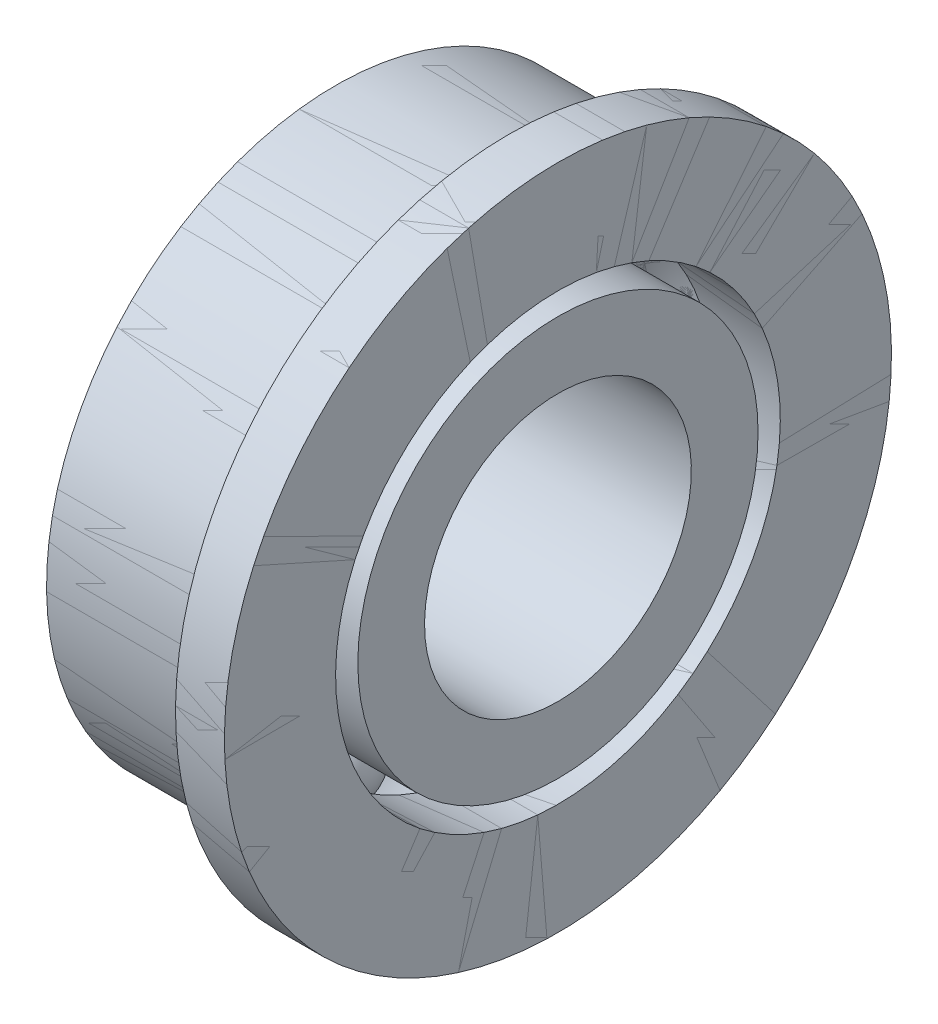
ISO-10303-21;
HEADER;
FILE_DESCRIPTION(('STEP AP214'),'2;1');
FILE_NAME('part.step','',(''),(''),'','','');
FILE_SCHEMA(('AUTOMOTIVE_DESIGN { 1 0 10303 214 1 1 1 1 }'));
ENDSEC;
DATA;
#1=APPLICATION_CONTEXT('core data for automotive mechanical design processes');
#2=APPLICATION_PROTOCOL_DEFINITION('international standard','automotive_design',2000,#1);
#3=PRODUCT_CONTEXT('',#1,'mechanical');
#4=PRODUCT('Part','Part','',(#3));
#5=PRODUCT_RELATED_PRODUCT_CATEGORY('part','',(#4));
#6=PRODUCT_DEFINITION_FORMATION('','',#4);
#7=PRODUCT_DEFINITION_CONTEXT('part definition',#1,'design');
#8=PRODUCT_DEFINITION('design','',#6,#7);
#9=PRODUCT_DEFINITION_SHAPE('','',#8);
#10=(LENGTH_UNIT() NAMED_UNIT(*) SI_UNIT(.MILLI.,.METRE.));
#11=(NAMED_UNIT(*) PLANE_ANGLE_UNIT() SI_UNIT($,.RADIAN.));
#12=(NAMED_UNIT(*) SI_UNIT($,.STERADIAN.) SOLID_ANGLE_UNIT());
#13=UNCERTAINTY_MEASURE_WITH_UNIT(LENGTH_MEASURE(1.E-05),#10,'distance_accuracy_value','');
#14=(GEOMETRIC_REPRESENTATION_CONTEXT(3) GLOBAL_UNCERTAINTY_ASSIGNED_CONTEXT((#13)) GLOBAL_UNIT_ASSIGNED_CONTEXT((#10,
#11,#12)) REPRESENTATION_CONTEXT('',''));
#15=CARTESIAN_POINT('',(0.,0.,0.));
#16=DIRECTION('',(0.,0.,1.));
#17=DIRECTION('',(1.,0.,0.));
#18=AXIS2_PLACEMENT_3D('',#15,#16,#17);
#19=CARTESIAN_POINT('',(-6.31921866442244,1.01574626800903,-15.2392354205598));
#20=DIRECTION('',(0.433227243676551,-0.012539546794911,0.901197489511925));
#21=DIRECTION('',(0.84392832847606,-0.345359327461976,-0.410502023540219));
#22=AXIS2_PLACEMENT_3D('',#19,#20,#21);
#23=SPHERICAL_SURFACE('',#22,1.);
#24=CARTESIAN_POINT('',(-5.88599142074589,1.00320672121412,-14.3380379310479));
#25=VERTEX_POINT('',#24);
#26=VERTEX_LOOP('',#25);
#27=FACE_BOUND('',#26,.T.);
#28=ADVANCED_FACE('P0_F13',(#27),#23,.T.);
#29=CLOSED_SHELL('',(#28));
#30=MANIFOLD_SOLID_BREP('P0_B1',#29);
#31=CARTESIAN_POINT('',(-6.31921866442243,-2.88926502988642,-12.5349080063385));
#32=DIRECTION('',(0.433227243676549,0.774190146346634,0.461458310832298));
#33=DIRECTION('',(0.843928328476061,-0.528184844421734,0.0938389392458731));
#34=AXIS2_PLACEMENT_3D('',#31,#32,#33);
#35=SPHERICAL_SURFACE('',#34,1.);
#36=CARTESIAN_POINT('',(-5.88599142074588,-2.11507488353978,-12.0734496955062));
#37=VERTEX_POINT('',#36);
#38=VERTEX_LOOP('',#37);
#39=FACE_BOUND('',#38,.T.);
#40=ADVANCED_FACE('P1_F13',(#39),#35,.T.);
#41=CLOSED_SHELL('',(#40));
#42=MANIFOLD_SOLID_BREP('P1_B1',#41);
#43=CARTESIAN_POINT('',(-6.31921866442242,-2.49975443796778,-7.80090531318512));
#44=DIRECTION('',(0.433227243676548,0.786729693141543,-0.439739178679629));
#45=DIRECTION('',(0.84392832847606,-0.182825516959753,0.504340962786091));
#46=AXIS2_PLACEMENT_3D('',#43,#44,#45);
#47=SPHERICAL_SURFACE('',#46,1.);
#48=CARTESIAN_POINT('',(-5.88599142074588,-1.71302474482624,-8.24064449186475));
#49=VERTEX_POINT('',#48);
#50=VERTEX_LOOP('',#49);
#51=FACE_BOUND('',#50,.T.);
#52=ADVANCED_FACE('P2_F13',(#51),#47,.T.);
#53=CLOSED_SHELL('',(#52));
#54=MANIFOLD_SOLID_BREP('P2_B1',#53);
#55=CARTESIAN_POINT('',(-6.31921866442243,1.79476745184631,-5.77123003425311));
#56=DIRECTION('',(0.433227243676549,0.0125395467949068,-0.901197489511926));
#57=DIRECTION('',(0.843928328476059,0.345359327461983,0.410502023540215));
#58=AXIS2_PLACEMENT_3D('',#55,#56,#57);
#59=SPHERICAL_SURFACE('',#58,1.);
#60=CARTESIAN_POINT('',(-5.88599142074588,1.80730699864121,-6.67242752376503));
#61=VERTEX_POINT('',#60);
#62=VERTEX_LOOP('',#61);
#63=FACE_BOUND('',#62,.T.);
#64=ADVANCED_FACE('P3_F13',(#63),#59,.T.);
#65=CLOSED_SHELL('',(#64));
#66=MANIFOLD_SOLID_BREP('P3_B1',#65);
#67=CARTESIAN_POINT('',(-6.31921866442244,5.69977874974173,-8.47555744847446));
#68=DIRECTION('',(0.433227243676551,-0.774190146346635,-0.461458310832294));
#69=DIRECTION('',(0.843928328476059,0.528184844421737,-0.0938389392458785));
#70=AXIS2_PLACEMENT_3D('',#67,#68,#69);
#71=SPHERICAL_SURFACE('',#70,1.);
#72=CARTESIAN_POINT('',(-5.88599142074589,4.9255886033951,-8.93701575930676));
#73=VERTEX_POINT('',#72);
#74=VERTEX_LOOP('',#73);
#75=FACE_BOUND('',#74,.T.);
#76=ADVANCED_FACE('P4_F13',(#75),#71,.T.);
#77=CLOSED_SHELL('',(#76));
#78=MANIFOLD_SOLID_BREP('P4_B1',#77);
#79=CARTESIAN_POINT('',(-6.31921866442245,5.31026815782306,-13.2095601416278));
#80=DIRECTION('',(0.433227243676552,-0.786729693141538,0.439739178679634));
#81=DIRECTION('',(0.843928328476059,0.182825516959754,-0.504340962786094));
#82=AXIS2_PLACEMENT_3D('',#79,#80,#81);
#83=SPHERICAL_SURFACE('',#82,1.);
#84=CARTESIAN_POINT('',(-5.88599142074589,4.52353846468152,-12.7698209629482));
#85=VERTEX_POINT('',#84);
#86=VERTEX_LOOP('',#85);
#87=FACE_BOUND('',#86,.T.);
#88=ADVANCED_FACE('P5_F12',(#87),#83,.T.);
#89=CLOSED_SHELL('',(#88));
#90=MANIFOLD_SOLID_BREP('P5_B1',#89);
#91=CARTESIAN_POINT('',(-6.31921866442243,1.40525685992765,-10.5052327274065));
#92=DIRECTION('',(-1.,0.,0.));
#93=DIRECTION('',(0.,0.704633641262034,-0.709571301281138));
#94=AXIS2_PLACEMENT_3D('',#91,#92,#93);
#95=CYLINDRICAL_SURFACE('',#94,4.5);
#96=CARTESIAN_POINT('',(-8.81921866442243,1.40525685992764,-10.5052327274065));
#97=DIRECTION('',(-1.,0.,0.));
#98=DIRECTION('',(0.,0.704633641262034,-0.709571301281138));
#99=AXIS2_PLACEMENT_3D('',#96,#97,#98);
#100=CIRCLE('',#99,4.5);
#101=CARTESIAN_POINT('',(-8.81921866442244,4.5761082456068,-13.6983035831716));
#102=VERTEX_POINT('',#101);
#103=EDGE_CURVE('P6_E10',#102,#102,#100,.T.);
#104=ORIENTED_EDGE('',*,*,#103,.F.);
#105=EDGE_LOOP('',(#104));
#106=FACE_BOUND('',#105,.T.);
#107=CARTESIAN_POINT('',(-7.28746450097429,1.40525685992765,-10.5052327274065));
#108=DIRECTION('',(-1.,0.,0.));
#109=DIRECTION('',(0.,0.704633641262034,-0.709571301281138));
#110=AXIS2_PLACEMENT_3D('',#107,#108,#109);
#111=CIRCLE('',#110,4.5);
#112=CARTESIAN_POINT('',(-7.2874645009743,4.5761082456068,-13.6983035831716));
#113=VERTEX_POINT('',#112);
#114=EDGE_CURVE('P6_E37',#113,#113,#111,.T.);
#115=ORIENTED_EDGE('',*,*,#114,.T.);
#116=EDGE_LOOP('',(#115));
#117=FACE_BOUND('',#116,.T.);
#118=ADVANCED_FACE('P6_F15',(#106,#117),#95,.T.);
#119=CARTESIAN_POINT('',(-8.81921866442243,-1.78781399583748,-13.6760841130856));
#120=DIRECTION('',(1.,0.,0.));
#121=DIRECTION('',(0.,-0.704633641262034,0.709571301281138));
#122=AXIS2_PLACEMENT_3D('',#119,#120,#121);
#123=PLANE('',#122);
#124=CARTESIAN_POINT('',(-8.81921866442243,1.40525685992764,-10.5052327274065));
#125=DIRECTION('',(-1.,0.,0.));
#126=DIRECTION('',(0.,0.704633641262034,-0.709571301281138));
#127=AXIS2_PLACEMENT_3D('',#124,#125,#126);
#128=CIRCLE('',#127,3.);
#129=CARTESIAN_POINT('',(-8.81921866442244,3.51915778371375,-12.6339466312499));
#130=VERTEX_POINT('',#129);
#131=EDGE_CURVE('P6_E21',#130,#130,#128,.T.);
#132=ORIENTED_EDGE('',*,*,#131,.F.);
#133=EDGE_LOOP('',(#132));
#134=FACE_BOUND('',#133,.T.);
#135=ORIENTED_EDGE('',*,*,#103,.T.);
#136=EDGE_LOOP('',(#135));
#137=FACE_BOUND('',#136,.T.);
#138=ADVANCED_FACE('P6_F62',(#134,#137),#123,.F.);
#139=CARTESIAN_POINT('',(-6.31921866442243,1.40525685992765,-10.5052327274065));
#140=DIRECTION('',(-1.,0.,0.));
#141=DIRECTION('',(0.,0.704633641262034,-0.709571301281138));
#142=AXIS2_PLACEMENT_3D('',#139,#140,#141);
#143=CYLINDRICAL_SURFACE('',#142,3.);
#144=CARTESIAN_POINT('',(-3.81921866442243,1.40525685992766,-10.5052327274065));
#145=DIRECTION('',(-1.,0.,0.));
#146=DIRECTION('',(0.,0.704633641262034,-0.709571301281138));
#147=AXIS2_PLACEMENT_3D('',#144,#145,#146);
#148=CIRCLE('',#147,3.);
#149=CARTESIAN_POINT('',(-3.81921866442244,3.51915778371376,-12.6339466312499));
#150=VERTEX_POINT('',#149);
#151=EDGE_CURVE('P6_E25',#150,#150,#148,.T.);
#152=ORIENTED_EDGE('',*,*,#151,.F.);
#153=EDGE_LOOP('',(#152));
#154=FACE_BOUND('',#153,.T.);
#155=ORIENTED_EDGE('',*,*,#131,.T.);
#156=EDGE_LOOP('',(#155));
#157=FACE_BOUND('',#156,.T.);
#158=ADVANCED_FACE('P6_F57',(#154,#157),#143,.F.);
#159=CARTESIAN_POINT('',(-3.81921866442243,-1.78781399583747,-13.6760841130856));
#160=DIRECTION('',(-1.,0.,0.));
#161=DIRECTION('',(0.,0.704633641262034,-0.709571301281138));
#162=AXIS2_PLACEMENT_3D('',#159,#160,#161);
#163=PLANE('',#162);
#164=CARTESIAN_POINT('',(-3.81921866442243,1.40525685992766,-10.5052327274065));
#165=DIRECTION('',(-1.,0.,0.));
#166=DIRECTION('',(0.,0.704633641262034,-0.709571301281138));
#167=AXIS2_PLACEMENT_3D('',#164,#165,#166);
#168=CIRCLE('',#167,4.5);
#169=CARTESIAN_POINT('',(-3.81921866442244,4.57610824560681,-13.6983035831716));
#170=VERTEX_POINT('',#169);
#171=EDGE_CURVE('P6_E29',#170,#170,#168,.T.);
#172=ORIENTED_EDGE('',*,*,#171,.F.);
#173=EDGE_LOOP('',(#172));
#174=FACE_BOUND('',#173,.T.);
#175=ORIENTED_EDGE('',*,*,#151,.T.);
#176=EDGE_LOOP('',(#175));
#177=FACE_BOUND('',#176,.T.);
#178=ADVANCED_FACE('P6_F51',(#174,#177),#163,.F.);
#179=CARTESIAN_POINT('',(-6.31921866442243,1.40525685992765,-10.5052327274065));
#180=DIRECTION('',(-1.,0.,0.));
#181=DIRECTION('',(0.,0.704633641262034,-0.709571301281138));
#182=AXIS2_PLACEMENT_3D('',#179,#180,#181);
#183=CYLINDRICAL_SURFACE('',#182,4.5);
#184=CARTESIAN_POINT('',(-5.35097282787058,1.40525685992765,-10.5052327274065));
#185=DIRECTION('',(-1.,0.,0.));
#186=DIRECTION('',(0.,0.704633641262034,-0.709571301281138));
#187=AXIS2_PLACEMENT_3D('',#184,#185,#186);
#188=CIRCLE('',#187,4.5);
#189=CARTESIAN_POINT('',(-5.35097282787059,4.5761082456068,-13.6983035831716));
#190=VERTEX_POINT('',#189);
#191=EDGE_CURVE('P6_E34',#190,#190,#188,.T.);
#192=ORIENTED_EDGE('',*,*,#191,.F.);
#193=EDGE_LOOP('',(#192));
#194=FACE_BOUND('',#193,.T.);
#195=ORIENTED_EDGE('',*,*,#171,.T.);
#196=EDGE_LOOP('',(#195));
#197=FACE_BOUND('',#196,.T.);
#198=ADVANCED_FACE('P6_F45',(#194,#197),#183,.T.);
#199=CARTESIAN_POINT('',(-6.31921866442243,1.40525685992765,-10.5052327274065));
#200=DIRECTION('',(-1.,0.,0.));
#201=DIRECTION('',(0.,0.704633641262034,-0.709571301281138));
#202=AXIS2_PLACEMENT_3D('',#199,#200,#201);
#203=TOROIDAL_SURFACE('',#202,4.75,1.);
#204=ORIENTED_EDGE('',*,*,#114,.F.);
#205=EDGE_LOOP('',(#204));
#206=FACE_BOUND('',#205,.T.);
#207=ORIENTED_EDGE('',*,*,#191,.T.);
#208=EDGE_LOOP('',(#207));
#209=FACE_BOUND('',#208,.T.);
#210=ADVANCED_FACE('P6_F42',(#206,#209),#203,.F.);
#211=CLOSED_SHELL('',(#118,#138,#158,#178,#198,#210));
#212=MANIFOLD_SOLID_BREP('P6_B1',#211);
#213=CARTESIAN_POINT('',(-8.81921866442244,7.33653215754657,-13.164174874926));
#214=DIRECTION('',(1.,0.,0.));
#215=DIRECTION('',(0.,-0.409068022695307,-0.912503891941372));
#216=AXIS2_PLACEMENT_3D('',#213,#214,#215);
#217=PLANE('',#216);
#218=CARTESIAN_POINT('',(-8.81921866442244,1.40525685992765,-10.5052327274065));
#219=DIRECTION('',(-1.,0.,0.));
#220=DIRECTION('',(0.,0.409068022695307,0.912503891941372));
#221=AXIS2_PLACEMENT_3D('',#218,#219,#220);
#222=CIRCLE('',#221,5.);
#223=CARTESIAN_POINT('',(-8.81921866442244,3.45059697340418,-5.9427132676996));
#224=VERTEX_POINT('',#223);
#225=EDGE_CURVE('P7_E10',#224,#224,#222,.T.);
#226=ORIENTED_EDGE('',*,*,#225,.F.);
#227=EDGE_LOOP('',(#226));
#228=FACE_BOUND('',#227,.T.);
#229=CARTESIAN_POINT('',(-8.81921866442244,1.40525685992765,-10.5052327274065));
#230=DIRECTION('',(-1.,0.,0.));
#231=DIRECTION('',(0.,0.409068022695307,0.912503891941372));
#232=AXIS2_PLACEMENT_3D('',#229,#230,#231);
#233=CIRCLE('',#232,6.5);
#234=CARTESIAN_POINT('',(-8.81921866442244,4.06419900744715,-4.57395742978754));
#235=VERTEX_POINT('',#234);
#236=EDGE_CURVE('P7_E43',#235,#235,#233,.T.);
#237=ORIENTED_EDGE('',*,*,#236,.T.);
#238=EDGE_LOOP('',(#237));
#239=FACE_BOUND('',#238,.T.);
#240=ADVANCED_FACE('P7_F15',(#228,#239),#217,.F.);
#241=CARTESIAN_POINT('',(-6.31921866442244,1.40525685992765,-10.5052327274065));
#242=DIRECTION('',(-1.,0.,0.));
#243=DIRECTION('',(0.,0.409068022695307,0.912503891941372));
#244=AXIS2_PLACEMENT_3D('',#241,#242,#243);
#245=CYLINDRICAL_SURFACE('',#244,5.);
#246=CARTESIAN_POINT('',(-7.2874645009743,1.40525685992765,-10.5052327274065));
#247=DIRECTION('',(-1.,0.,0.));
#248=DIRECTION('',(0.,0.409068022695307,0.912503891941372));
#249=AXIS2_PLACEMENT_3D('',#246,#247,#248);
#250=CIRCLE('',#249,5.);
#251=CARTESIAN_POINT('',(-7.2874645009743,3.45059697340419,-5.9427132676996));
#252=VERTEX_POINT('',#251);
#253=EDGE_CURVE('P7_E21',#252,#252,#250,.T.);
#254=ORIENTED_EDGE('',*,*,#253,.F.);
#255=EDGE_LOOP('',(#254));
#256=FACE_BOUND('',#255,.T.);
#257=ORIENTED_EDGE('',*,*,#225,.T.);
#258=EDGE_LOOP('',(#257));
#259=FACE_BOUND('',#258,.T.);
#260=ADVANCED_FACE('P7_F80',(#256,#259),#245,.F.);
#261=CARTESIAN_POINT('',(-6.31921866442244,1.40525685992765,-10.5052327274065));
#262=DIRECTION('',(-1.,0.,0.));
#263=DIRECTION('',(0.,0.409068022695307,0.912503891941372));
#264=AXIS2_PLACEMENT_3D('',#261,#262,#263);
#265=TOROIDAL_SURFACE('',#264,4.75,1.);
#266=CARTESIAN_POINT('',(-5.35097282787059,1.40525685992765,-10.5052327274065));
#267=DIRECTION('',(-1.,0.,0.));
#268=DIRECTION('',(0.,0.409068022695307,0.912503891941372));
#269=AXIS2_PLACEMENT_3D('',#266,#267,#268);
#270=CIRCLE('',#269,5.);
#271=CARTESIAN_POINT('',(-5.35097282787059,3.45059697340419,-5.9427132676996));
#272=VERTEX_POINT('',#271);
#273=EDGE_CURVE('P7_E25',#272,#272,#270,.T.);
#274=ORIENTED_EDGE('',*,*,#273,.F.);
#275=EDGE_LOOP('',(#274));
#276=FACE_BOUND('',#275,.T.);
#277=ORIENTED_EDGE('',*,*,#253,.T.);
#278=EDGE_LOOP('',(#277));
#279=FACE_BOUND('',#278,.T.);
#280=ADVANCED_FACE('P7_F75',(#276,#279),#265,.F.);
#281=CARTESIAN_POINT('',(-6.31921866442244,1.40525685992765,-10.5052327274065));
#282=DIRECTION('',(-1.,0.,0.));
#283=DIRECTION('',(0.,0.409068022695307,0.912503891941372));
#284=AXIS2_PLACEMENT_3D('',#281,#282,#283);
#285=CYLINDRICAL_SURFACE('',#284,5.);
#286=CARTESIAN_POINT('',(-3.81921866442244,1.40525685992765,-10.5052327274065));
#287=DIRECTION('',(-1.,0.,0.));
#288=DIRECTION('',(0.,0.409068022695307,0.912503891941372));
#289=AXIS2_PLACEMENT_3D('',#286,#287,#288);
#290=CIRCLE('',#289,5.);
#291=CARTESIAN_POINT('',(-3.81921866442244,3.45059697340419,-5.9427132676996));
#292=VERTEX_POINT('',#291);
#293=EDGE_CURVE('P7_E29',#292,#292,#290,.T.);
#294=ORIENTED_EDGE('',*,*,#293,.F.);
#295=EDGE_LOOP('',(#294));
#296=FACE_BOUND('',#295,.T.);
#297=ORIENTED_EDGE('',*,*,#273,.T.);
#298=EDGE_LOOP('',(#297));
#299=FACE_BOUND('',#298,.T.);
#300=ADVANCED_FACE('P7_F69',(#296,#299),#285,.F.);
#301=CARTESIAN_POINT('',(-3.81921866442244,7.33653215754657,-13.164174874926));
#302=DIRECTION('',(-1.,0.,0.));
#303=DIRECTION('',(0.,0.409068022695307,0.912503891941372));
#304=AXIS2_PLACEMENT_3D('',#301,#302,#303);
#305=PLANE('',#304);
#306=CARTESIAN_POINT('',(-3.81921866442244,1.40525685992765,-10.5052327274065));
#307=DIRECTION('',(-1.,0.,0.));
#308=DIRECTION('',(0.,0.409068022695307,0.912503891941372));
#309=AXIS2_PLACEMENT_3D('',#306,#307,#308);
#310=CIRCLE('',#309,7.5);
#311=CARTESIAN_POINT('',(-3.81921866442244,4.47326703014245,-3.66145353784617));
#312=VERTEX_POINT('',#311);
#313=EDGE_CURVE('P7_E34',#312,#312,#310,.T.);
#314=ORIENTED_EDGE('',*,*,#313,.F.);
#315=EDGE_LOOP('',(#314));
#316=FACE_BOUND('',#315,.T.);
#317=ORIENTED_EDGE('',*,*,#293,.T.);
#318=EDGE_LOOP('',(#317));
#319=FACE_BOUND('',#318,.T.);
#320=ADVANCED_FACE('P7_F63',(#316,#319),#305,.F.);
#321=CARTESIAN_POINT('',(-6.31921866442244,1.40525685992765,-10.5052327274065));
#322=DIRECTION('',(-1.,0.,0.));
#323=DIRECTION('',(0.,0.409068022695307,0.912503891941372));
#324=AXIS2_PLACEMENT_3D('',#321,#322,#323);
#325=CYLINDRICAL_SURFACE('',#324,7.5);
#326=CARTESIAN_POINT('',(-4.91921866442244,1.40525685992765,-10.5052327274065));
#327=DIRECTION('',(-1.,0.,0.));
#328=DIRECTION('',(0.,0.409068022695307,0.912503891941372));
#329=AXIS2_PLACEMENT_3D('',#326,#327,#328);
#330=CIRCLE('',#329,7.5);
#331=CARTESIAN_POINT('',(-4.91921866442244,4.47326703014245,-3.66145353784617));
#332=VERTEX_POINT('',#331);
#333=EDGE_CURVE('P7_E37',#332,#332,#330,.T.);
#334=ORIENTED_EDGE('',*,*,#333,.F.);
#335=EDGE_LOOP('',(#334));
#336=FACE_BOUND('',#335,.T.);
#337=ORIENTED_EDGE('',*,*,#313,.T.);
#338=EDGE_LOOP('',(#337));
#339=FACE_BOUND('',#338,.T.);
#340=ADVANCED_FACE('P7_F57',(#336,#339),#325,.T.);
#341=CARTESIAN_POINT('',(-4.91921866442244,8.24903604948794,-13.5732428976213));
#342=DIRECTION('',(1.,0.,0.));
#343=DIRECTION('',(0.,-0.409068022695307,-0.912503891941372));
#344=AXIS2_PLACEMENT_3D('',#341,#342,#343);
#345=PLANE('',#344);
#346=CARTESIAN_POINT('',(-4.91921866442244,1.40525685992765,-10.5052327274065));
#347=DIRECTION('',(-1.,0.,0.));
#348=DIRECTION('',(0.,0.409068022695307,0.912503891941372));
#349=AXIS2_PLACEMENT_3D('',#346,#347,#348);
#350=CIRCLE('',#349,6.5);
#351=CARTESIAN_POINT('',(-4.91921866442244,4.06419900744715,-4.57395742978754));
#352=VERTEX_POINT('',#351);
#353=EDGE_CURVE('P7_E40',#352,#352,#350,.T.);
#354=ORIENTED_EDGE('',*,*,#353,.F.);
#355=EDGE_LOOP('',(#354));
#356=FACE_BOUND('',#355,.T.);
#357=ORIENTED_EDGE('',*,*,#333,.T.);
#358=EDGE_LOOP('',(#357));
#359=FACE_BOUND('',#358,.T.);
#360=ADVANCED_FACE('P7_F51',(#356,#359),#345,.F.);
#361=CARTESIAN_POINT('',(-6.31921866442244,1.40525685992765,-10.5052327274065));
#362=DIRECTION('',(-1.,0.,0.));
#363=DIRECTION('',(0.,0.409068022695307,0.912503891941372));
#364=AXIS2_PLACEMENT_3D('',#361,#362,#363);
#365=CYLINDRICAL_SURFACE('',#364,6.5);
#366=ORIENTED_EDGE('',*,*,#236,.F.);
#367=EDGE_LOOP('',(#366));
#368=FACE_BOUND('',#367,.T.);
#369=ORIENTED_EDGE('',*,*,#353,.T.);
#370=EDGE_LOOP('',(#369));
#371=FACE_BOUND('',#370,.T.);
#372=ADVANCED_FACE('P7_F48',(#368,#371),#365,.T.);
#373=CLOSED_SHELL('',(#240,#260,#280,#300,#320,#340,#360,#372));
#374=MANIFOLD_SOLID_BREP('P7_B1',#373);
#375=CARTESIAN_POINT('',(-6.31921866442244,1.40525685992765,-10.5052327274065));
#376=DIRECTION('',(-1.,0.,0.));
#377=DIRECTION('',(0.,0.409068022695307,0.912503891941372));
#378=AXIS2_PLACEMENT_3D('',#375,#376,#377);
#379=TOROIDAL_SURFACE('',#378,4.75,1.);
#380=CARTESIAN_POINT('',(-7.2874645009743,1.40525685992765,-10.5052327274065));
#381=DIRECTION('',(-1.,0.,0.));
#382=DIRECTION('',(0.,0.409068022695307,0.912503891941372));
#383=AXIS2_PLACEMENT_3D('',#380,#381,#382);
#384=CIRCLE('',#383,5.);
#385=CARTESIAN_POINT('',(-7.2874645009743,3.45059697340419,-5.9427132676996));
#386=VERTEX_POINT('',#385);
#387=EDGE_CURVE('P8_E43',#386,#386,#384,.T.);
#388=ORIENTED_EDGE('',*,*,#387,.T.);
#389=EDGE_LOOP('',(#388));
#390=FACE_BOUND('',#389,.T.);
#391=CARTESIAN_POINT('',(-5.35097282787059,1.40525685992765,-10.5052327274065));
#392=DIRECTION('',(-1.,0.,0.));
#393=DIRECTION('',(0.,0.409068022695307,0.912503891941372));
#394=AXIS2_PLACEMENT_3D('',#391,#392,#393);
#395=CIRCLE('',#394,5.);
#396=CARTESIAN_POINT('',(-5.35097282787059,3.45059697340419,-5.9427132676996));
#397=VERTEX_POINT('',#396);
#398=EDGE_CURVE('P8_E10',#397,#397,#395,.T.);
#399=ORIENTED_EDGE('',*,*,#398,.F.);
#400=EDGE_LOOP('',(#399));
#401=FACE_BOUND('',#400,.T.);
#402=ADVANCED_FACE('P8_F15',(#390,#401),#379,.F.);
#403=CARTESIAN_POINT('',(-6.31921866442244,1.40525685992765,-10.5052327274065));
#404=DIRECTION('',(-1.,0.,0.));
#405=DIRECTION('',(0.,0.409068022695307,0.912503891941372));
#406=AXIS2_PLACEMENT_3D('',#403,#404,#405);
#407=CYLINDRICAL_SURFACE('',#406,5.);
#408=ORIENTED_EDGE('',*,*,#398,.T.);
#409=EDGE_LOOP('',(#408));
#410=FACE_BOUND('',#409,.T.);
#411=CARTESIAN_POINT('',(-3.81921866442244,1.40525685992765,-10.5052327274065));
#412=DIRECTION('',(-1.,0.,0.));
#413=DIRECTION('',(0.,0.409068022695307,0.912503891941372));
#414=AXIS2_PLACEMENT_3D('',#411,#412,#413);
#415=CIRCLE('',#414,5.);
#416=CARTESIAN_POINT('',(-3.81921866442244,3.45059697340419,-5.9427132676996));
#417=VERTEX_POINT('',#416);
#418=EDGE_CURVE('P8_E21',#417,#417,#415,.T.);
#419=ORIENTED_EDGE('',*,*,#418,.F.);
#420=EDGE_LOOP('',(#419));
#421=FACE_BOUND('',#420,.T.);
#422=ADVANCED_FACE('P8_F62',(#410,#421),#407,.F.);
#423=CARTESIAN_POINT('',(-3.81921866442244,-4.52601843769127,-7.84629057988696));
#424=DIRECTION('',(1.,0.,0.));
#425=DIRECTION('',(0.,-0.409068022695307,-0.912503891941372));
#426=AXIS2_PLACEMENT_3D('',#423,#424,#425);
#427=PLANE('',#426);
#428=ORIENTED_EDGE('',*,*,#418,.T.);
#429=EDGE_LOOP('',(#428));
#430=FACE_BOUND('',#429,.T.);
#431=CARTESIAN_POINT('',(-3.81921866442244,1.40525685992765,-10.5052327274065));
#432=DIRECTION('',(-1.,0.,0.));
#433=DIRECTION('',(0.,0.409068022695307,0.912503891941372));
#434=AXIS2_PLACEMENT_3D('',#431,#432,#433);
#435=CIRCLE('',#434,7.5);
#436=CARTESIAN_POINT('',(-3.81921866442244,4.47326703014245,-3.66145353784617));
#437=VERTEX_POINT('',#436);
#438=EDGE_CURVE('P8_E25',#437,#437,#435,.T.);
#439=ORIENTED_EDGE('',*,*,#438,.F.);
#440=EDGE_LOOP('',(#439));
#441=FACE_BOUND('',#440,.T.);
#442=ADVANCED_FACE('P8_F66',(#430,#441),#427,.T.);
#443=CARTESIAN_POINT('',(-6.31921866442244,1.40525685992765,-10.5052327274065));
#444=DIRECTION('',(-1.,0.,0.));
#445=DIRECTION('',(0.,0.409068022695307,0.912503891941372));
#446=AXIS2_PLACEMENT_3D('',#443,#444,#445);
#447=CYLINDRICAL_SURFACE('',#446,7.5);
#448=ORIENTED_EDGE('',*,*,#438,.T.);
#449=EDGE_LOOP('',(#448));
#450=FACE_BOUND('',#449,.T.);
#451=CARTESIAN_POINT('',(-4.91921866442244,1.40525685992765,-10.5052327274065));
#452=DIRECTION('',(-1.,0.,0.));
#453=DIRECTION('',(0.,0.409068022695307,0.912503891941372));
#454=AXIS2_PLACEMENT_3D('',#451,#452,#453);
#455=CIRCLE('',#454,7.5);
#456=CARTESIAN_POINT('',(-4.91921866442244,4.47326703014245,-3.66145353784617));
#457=VERTEX_POINT('',#456);
#458=EDGE_CURVE('P8_E29',#457,#457,#455,.T.);
#459=ORIENTED_EDGE('',*,*,#458,.F.);
#460=EDGE_LOOP('',(#459));
#461=FACE_BOUND('',#460,.T.);
#462=ADVANCED_FACE('P8_F70',(#450,#461),#447,.T.);
#463=CARTESIAN_POINT('',(-4.91921866442244,-5.43852232963264,-7.43722255719165));
#464=DIRECTION('',(-1.,0.,0.));
#465=DIRECTION('',(0.,0.409068022695307,0.912503891941372));
#466=AXIS2_PLACEMENT_3D('',#463,#464,#465);
#467=PLANE('',#466);
#468=ORIENTED_EDGE('',*,*,#458,.T.);
#469=EDGE_LOOP('',(#468));
#470=FACE_BOUND('',#469,.T.);
#471=CARTESIAN_POINT('',(-4.91921866442244,1.40525685992765,-10.5052327274065));
#472=DIRECTION('',(-1.,0.,0.));
#473=DIRECTION('',(0.,0.409068022695307,0.912503891941372));
#474=AXIS2_PLACEMENT_3D('',#471,#472,#473);
#475=CIRCLE('',#474,6.5);
#476=CARTESIAN_POINT('',(-4.91921866442244,4.06419900744715,-4.57395742978754));
#477=VERTEX_POINT('',#476);
#478=EDGE_CURVE('P8_E34',#477,#477,#475,.T.);
#479=ORIENTED_EDGE('',*,*,#478,.F.);
#480=EDGE_LOOP('',(#479));
#481=FACE_BOUND('',#480,.T.);
#482=ADVANCED_FACE('P8_F76',(#470,#481),#467,.T.);
#483=CARTESIAN_POINT('',(-6.31921866442244,1.40525685992765,-10.5052327274065));
#484=DIRECTION('',(-1.,0.,0.));
#485=DIRECTION('',(0.,0.409068022695307,0.912503891941372));
#486=AXIS2_PLACEMENT_3D('',#483,#484,#485);
#487=CYLINDRICAL_SURFACE('',#486,6.5);
#488=ORIENTED_EDGE('',*,*,#478,.T.);
#489=EDGE_LOOP('',(#488));
#490=FACE_BOUND('',#489,.T.);
#491=CARTESIAN_POINT('',(-8.81921866442244,1.40525685992765,-10.5052327274065));
#492=DIRECTION('',(-1.,0.,0.));
#493=DIRECTION('',(0.,0.409068022695307,0.912503891941372));
#494=AXIS2_PLACEMENT_3D('',#491,#492,#493);
#495=CIRCLE('',#494,6.5);
#496=CARTESIAN_POINT('',(-8.81921866442244,4.06419900744715,-4.57395742978754));
#497=VERTEX_POINT('',#496);
#498=EDGE_CURVE('P8_E37',#497,#497,#495,.T.);
#499=ORIENTED_EDGE('',*,*,#498,.F.);
#500=EDGE_LOOP('',(#499));
#501=FACE_BOUND('',#500,.T.);
#502=ADVANCED_FACE('P8_F58',(#490,#501),#487,.T.);
#503=CARTESIAN_POINT('',(-8.81921866442244,-4.52601843769127,-7.84629057988696));
#504=DIRECTION('',(-1.,0.,0.));
#505=DIRECTION('',(0.,0.409068022695307,0.912503891941372));
#506=AXIS2_PLACEMENT_3D('',#503,#504,#505);
#507=PLANE('',#506);
#508=ORIENTED_EDGE('',*,*,#498,.T.);
#509=EDGE_LOOP('',(#508));
#510=FACE_BOUND('',#509,.T.);
#511=CARTESIAN_POINT('',(-8.81921866442244,1.40525685992765,-10.5052327274065));
#512=DIRECTION('',(-1.,0.,0.));
#513=DIRECTION('',(0.,0.409068022695307,0.912503891941372));
#514=AXIS2_PLACEMENT_3D('',#511,#512,#513);
#515=CIRCLE('',#514,5.);
#516=CARTESIAN_POINT('',(-8.81921866442244,3.45059697340418,-5.9427132676996));
#517=VERTEX_POINT('',#516);
#518=EDGE_CURVE('P8_E40',#517,#517,#515,.T.);
#519=ORIENTED_EDGE('',*,*,#518,.F.);
#520=EDGE_LOOP('',(#519));
#521=FACE_BOUND('',#520,.T.);
#522=ADVANCED_FACE('P8_F51',(#510,#521),#507,.T.);
#523=CARTESIAN_POINT('',(-6.31921866442244,1.40525685992765,-10.5052327274065));
#524=DIRECTION('',(-1.,0.,0.));
#525=DIRECTION('',(0.,0.409068022695307,0.912503891941372));
#526=AXIS2_PLACEMENT_3D('',#523,#524,#525);
#527=CYLINDRICAL_SURFACE('',#526,5.);
#528=ORIENTED_EDGE('',*,*,#518,.T.);
#529=EDGE_LOOP('',(#528));
#530=FACE_BOUND('',#529,.T.);
#531=ORIENTED_EDGE('',*,*,#387,.F.);
#532=EDGE_LOOP('',(#531));
#533=FACE_BOUND('',#532,.T.);
#534=ADVANCED_FACE('P8_F49',(#530,#533),#527,.F.);
#535=CLOSED_SHELL('',(#402,#422,#442,#462,#482,#502,#522,#534));
#536=MANIFOLD_SOLID_BREP('P8_B1',#535);
#537=ADVANCED_BREP_SHAPE_REPRESENTATION('',(#18,#30,#42,#54,#66,#78,#90,#212,#374,#536),#14);
#538=SHAPE_DEFINITION_REPRESENTATION(#9,#537);
ENDSEC;
END-ISO-10303-21;
